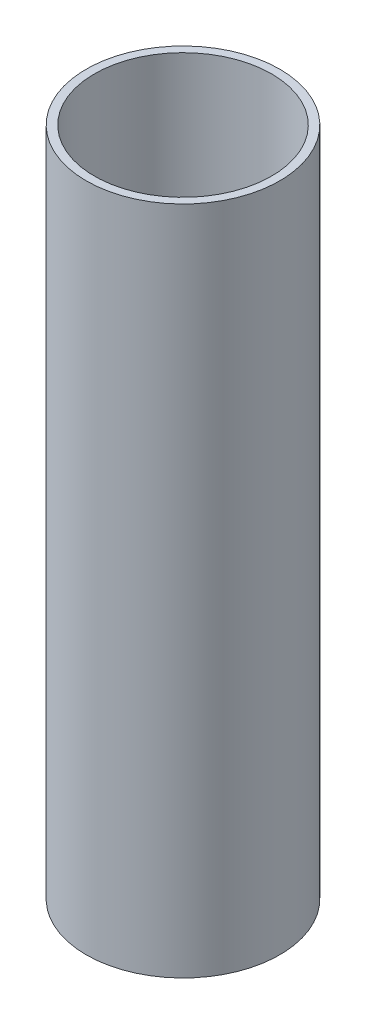
ISO-10303-21;
HEADER;
FILE_DESCRIPTION(('STEP AP214'),'2;1');
FILE_NAME('part.step','',(''),(''),'','','');
FILE_SCHEMA(('AUTOMOTIVE_DESIGN { 1 0 10303 214 1 1 1 1 }'));
ENDSEC;
DATA;
#1=APPLICATION_CONTEXT('core data for automotive mechanical design processes');
#2=APPLICATION_PROTOCOL_DEFINITION('international standard','automotive_design',2000,#1);
#3=PRODUCT_CONTEXT('',#1,'mechanical');
#4=PRODUCT('Part','Part','',(#3));
#5=PRODUCT_RELATED_PRODUCT_CATEGORY('part','',(#4));
#6=PRODUCT_DEFINITION_FORMATION('','',#4);
#7=PRODUCT_DEFINITION_CONTEXT('part definition',#1,'design');
#8=PRODUCT_DEFINITION('design','',#6,#7);
#9=PRODUCT_DEFINITION_SHAPE('','',#8);
#10=(LENGTH_UNIT() NAMED_UNIT(*) SI_UNIT(.MILLI.,.METRE.));
#11=(NAMED_UNIT(*) PLANE_ANGLE_UNIT() SI_UNIT($,.RADIAN.));
#12=(NAMED_UNIT(*) SI_UNIT($,.STERADIAN.) SOLID_ANGLE_UNIT());
#13=UNCERTAINTY_MEASURE_WITH_UNIT(LENGTH_MEASURE(1.E-05),#10,'distance_accuracy_value','');
#14=(GEOMETRIC_REPRESENTATION_CONTEXT(3) GLOBAL_UNCERTAINTY_ASSIGNED_CONTEXT((#13)) GLOBAL_UNIT_ASSIGNED_CONTEXT((#10,
#11,#12)) REPRESENTATION_CONTEXT('',''));
#15=CARTESIAN_POINT('',(0.,0.,0.));
#16=DIRECTION('',(0.,0.,1.));
#17=DIRECTION('',(1.,0.,0.));
#18=AXIS2_PLACEMENT_3D('',#15,#16,#17);
#19=CARTESIAN_POINT('',(0.,0.,0.));
#20=DIRECTION('',(0.,-1.,0.));
#21=DIRECTION('',(0.,0.,-1.));
#22=AXIS2_PLACEMENT_3D('',#19,#20,#21);
#23=CYLINDRICAL_SURFACE('',#22,21.15);
#24=CARTESIAN_POINT('',(0.,0.,0.));
#25=DIRECTION('',(0.,-1.,0.));
#26=DIRECTION('',(0.,0.,-1.));
#27=AXIS2_PLACEMENT_3D('',#24,#25,#26);
#28=CIRCLE('',#27,21.15);
#29=CARTESIAN_POINT('',(0.,0.,-21.15));
#30=VERTEX_POINT('',#29);
#31=EDGE_CURVE('E53',#30,#30,#28,.T.);
#32=ORIENTED_EDGE('',*,*,#31,.T.);
#33=EDGE_LOOP('',(#32));
#34=FACE_BOUND('',#33,.T.);
#35=CARTESIAN_POINT('',(0.,160.,0.));
#36=DIRECTION('',(0.,-1.,0.));
#37=DIRECTION('',(0.,0.,-1.));
#38=AXIS2_PLACEMENT_3D('',#35,#36,#37);
#39=CIRCLE('',#38,21.15);
#40=CARTESIAN_POINT('',(0.,160.,-21.15));
#41=VERTEX_POINT('',#40);
#42=EDGE_CURVE('E10',#41,#41,#39,.T.);
#43=ORIENTED_EDGE('',*,*,#42,.F.);
#44=EDGE_LOOP('',(#43));
#45=FACE_BOUND('',#44,.T.);
#46=ADVANCED_FACE('F39',(#34,#45),#23,.F.);
#47=CARTESIAN_POINT('',(0.,160.,-21.15));
#48=DIRECTION('',(0.,1.,0.));
#49=DIRECTION('',(0.,0.,1.));
#50=AXIS2_PLACEMENT_3D('',#47,#48,#49);
#51=PLANE('',#50);
#52=ORIENTED_EDGE('',*,*,#42,.T.);
#53=EDGE_LOOP('',(#52));
#54=FACE_BOUND('',#53,.T.);
#55=CARTESIAN_POINT('',(0.,160.,0.));
#56=DIRECTION('',(0.,-1.,0.));
#57=DIRECTION('',(0.,0.,-1.));
#58=AXIS2_PLACEMENT_3D('',#55,#56,#57);
#59=CIRCLE('',#58,23.1);
#60=CARTESIAN_POINT('',(0.,160.,-23.1));
#61=VERTEX_POINT('',#60);
#62=EDGE_CURVE('E45',#61,#61,#59,.T.);
#63=ORIENTED_EDGE('',*,*,#62,.F.);
#64=EDGE_LOOP('',(#63));
#65=FACE_BOUND('',#64,.T.);
#66=ADVANCED_FACE('F69',(#54,#65),#51,.T.);
#67=CARTESIAN_POINT('',(0.,0.,0.));
#68=DIRECTION('',(0.,-1.,0.));
#69=DIRECTION('',(0.,0.,-1.));
#70=AXIS2_PLACEMENT_3D('',#67,#68,#69);
#71=CYLINDRICAL_SURFACE('',#70,23.1);
#72=ORIENTED_EDGE('',*,*,#62,.T.);
#73=EDGE_LOOP('',(#72));
#74=FACE_BOUND('',#73,.T.);
#75=CARTESIAN_POINT('',(0.,0.,0.));
#76=DIRECTION('',(0.,-1.,0.));
#77=DIRECTION('',(0.,0.,-1.));
#78=AXIS2_PLACEMENT_3D('',#75,#76,#77);
#79=CIRCLE('',#78,23.1);
#80=CARTESIAN_POINT('',(0.,0.,-23.1));
#81=VERTEX_POINT('',#80);
#82=EDGE_CURVE('E49',#81,#81,#79,.T.);
#83=ORIENTED_EDGE('',*,*,#82,.F.);
#84=EDGE_LOOP('',(#83));
#85=FACE_BOUND('',#84,.T.);
#86=ADVANCED_FACE('F63',(#74,#85),#71,.T.);
#87=CARTESIAN_POINT('',(0.,0.,-21.15));
#88=DIRECTION('',(0.,-1.,0.));
#89=DIRECTION('',(0.,0.,-1.));
#90=AXIS2_PLACEMENT_3D('',#87,#88,#89);
#91=PLANE('',#90);
#92=ORIENTED_EDGE('',*,*,#82,.T.);
#93=EDGE_LOOP('',(#92));
#94=FACE_BOUND('',#93,.T.);
#95=ORIENTED_EDGE('',*,*,#31,.F.);
#96=EDGE_LOOP('',(#95));
#97=FACE_BOUND('',#96,.T.);
#98=ADVANCED_FACE('F61',(#94,#97),#91,.T.);
#99=CLOSED_SHELL('',(#46,#66,#86,#98));
#100=MANIFOLD_SOLID_BREP('B2',#99);
#101=ADVANCED_BREP_SHAPE_REPRESENTATION('',(#18,#100),#14);
#102=SHAPE_DEFINITION_REPRESENTATION(#9,#101);
ENDSEC;
END-ISO-10303-21;
